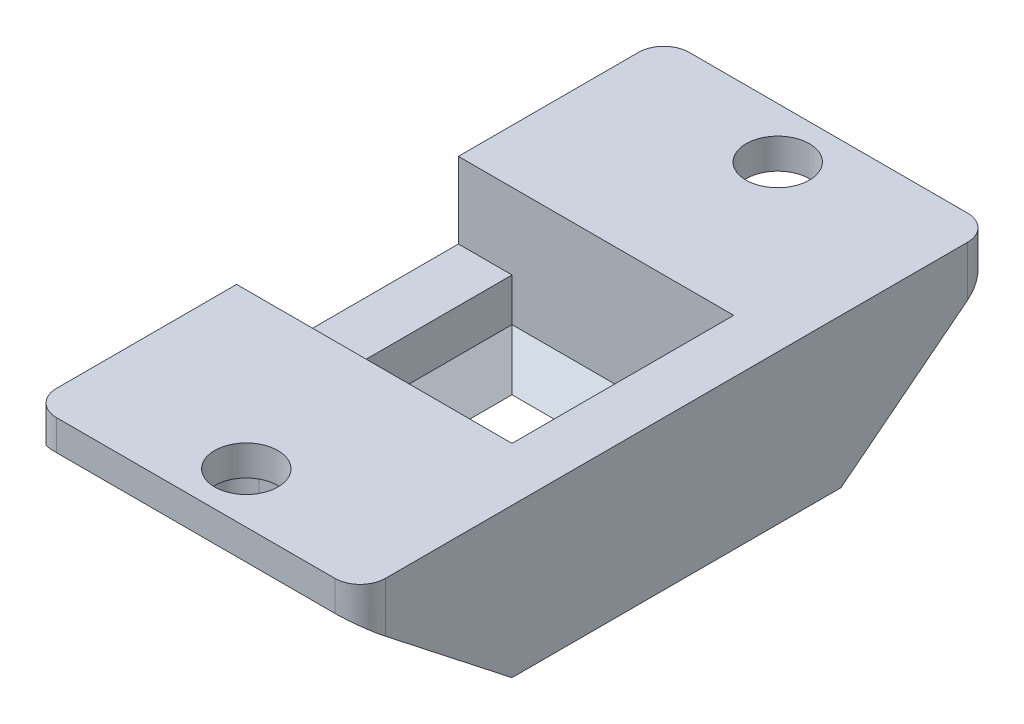
ISO-10303-21;
HEADER;
FILE_DESCRIPTION(('STEP AP214'),'2;1');
FILE_NAME('part.step','',(''),(''),'','','');
FILE_SCHEMA(('AUTOMOTIVE_DESIGN { 1 0 10303 214 1 1 1 1 }'));
ENDSEC;
DATA;
#1=APPLICATION_CONTEXT('core data for automotive mechanical design processes');
#2=APPLICATION_PROTOCOL_DEFINITION('international standard','automotive_design',2000,#1);
#3=PRODUCT_CONTEXT('',#1,'mechanical');
#4=PRODUCT('Part','Part','',(#3));
#5=PRODUCT_RELATED_PRODUCT_CATEGORY('part','',(#4));
#6=PRODUCT_DEFINITION_FORMATION('','',#4);
#7=PRODUCT_DEFINITION_CONTEXT('part definition',#1,'design');
#8=PRODUCT_DEFINITION('design','',#6,#7);
#9=PRODUCT_DEFINITION_SHAPE('','',#8);
#10=(LENGTH_UNIT() NAMED_UNIT(*) SI_UNIT(.MILLI.,.METRE.));
#11=(NAMED_UNIT(*) PLANE_ANGLE_UNIT() SI_UNIT($,.RADIAN.));
#12=(NAMED_UNIT(*) SI_UNIT($,.STERADIAN.) SOLID_ANGLE_UNIT());
#13=UNCERTAINTY_MEASURE_WITH_UNIT(LENGTH_MEASURE(1.E-05),#10,'distance_accuracy_value','');
#14=(GEOMETRIC_REPRESENTATION_CONTEXT(3) GLOBAL_UNCERTAINTY_ASSIGNED_CONTEXT((#13)) GLOBAL_UNIT_ASSIGNED_CONTEXT((#10,
#11,#12)) REPRESENTATION_CONTEXT('',''));
#15=CARTESIAN_POINT('',(0.,0.,0.));
#16=DIRECTION('',(0.,0.,1.));
#17=DIRECTION('',(1.,0.,0.));
#18=AXIS2_PLACEMENT_3D('',#15,#16,#17);
#19=CARTESIAN_POINT('',(-6.5,28.9847763108502,6.5));
#20=DIRECTION('',(0.,0.,1.));
#21=DIRECTION('',(1.,0.,0.));
#22=AXIS2_PLACEMENT_3D('',#19,#20,#21);
#23=PLANE('',#22);
#24=DIRECTION('',(1.,0.,0.));
#25=VECTOR('',#24,1.);
#26=CARTESIAN_POINT('',(-6.5,4.7,6.5));
#27=LINE('',#26,#25);
#28=CARTESIAN_POINT('',(-3.5,4.7,6.5));
#29=VERTEX_POINT('',#28);
#30=CARTESIAN_POINT('',(3.5,4.7,6.5));
#31=VERTEX_POINT('',#30);
#32=EDGE_CURVE('E389',#29,#31,#27,.T.);
#33=ORIENTED_EDGE('',*,*,#32,.F.);
#34=DIRECTION('',(0.,-1.,0.));
#35=VECTOR('',#34,1.);
#36=CARTESIAN_POINT('',(-3.5,28.9847763108502,6.5));
#37=LINE('',#36,#35);
#38=CARTESIAN_POINT('',(-3.5,0.,6.5));
#39=VERTEX_POINT('',#38);
#40=EDGE_CURVE('E312',#29,#39,#37,.T.);
#41=ORIENTED_EDGE('',*,*,#40,.T.);
#42=DIRECTION('',(-1.,0.,0.));
#43=VECTOR('',#42,1.);
#44=CARTESIAN_POINT('',(-6.5,0.,6.5));
#45=LINE('',#44,#43);
#46=CARTESIAN_POINT('',(3.5,0.,6.5));
#47=VERTEX_POINT('',#46);
#48=EDGE_CURVE('E425',#47,#39,#45,.T.);
#49=ORIENTED_EDGE('',*,*,#48,.F.);
#50=DIRECTION('',(0.,-1.,0.));
#51=VECTOR('',#50,1.);
#52=CARTESIAN_POINT('',(3.5,28.9847763108502,6.5));
#53=LINE('',#52,#51);
#54=EDGE_CURVE('E310',#47,#31,#53,.F.);
#55=ORIENTED_EDGE('',*,*,#54,.T.);
#56=EDGE_LOOP('',(#33,#41,#49,#55));
#57=FACE_BOUND('',#56,.T.);
#58=ADVANCED_FACE('F35',(#57),#23,.T.);
#59=CARTESIAN_POINT('',(0.,4.7,0.));
#60=DIRECTION('',(0.,-1.,0.));
#61=DIRECTION('',(0.,0.,1.));
#62=AXIS2_PLACEMENT_3D('',#59,#60,#61);
#63=PLANE('',#62);
#64=CARTESIAN_POINT('',(0.,4.7,10.5));
#65=DIRECTION('',(0.,-1.,0.));
#66=DIRECTION('',(0.,0.,-1.));
#67=AXIS2_PLACEMENT_3D('',#64,#65,#66);
#68=CIRCLE('',#67,1.25);
#69=CARTESIAN_POINT('',(0.,4.7,9.25));
#70=VERTEX_POINT('',#69);
#71=EDGE_CURVE('E406',#70,#70,#68,.T.);
#72=ORIENTED_EDGE('',*,*,#71,.F.);
#73=EDGE_LOOP('',(#72));
#74=FACE_BOUND('',#73,.T.);
#75=DIRECTION('',(0.,0.,-1.));
#76=VECTOR('',#75,1.);
#77=CARTESIAN_POINT('',(-4.5,4.7,12.5));
#78=LINE('',#77,#76);
#79=CARTESIAN_POINT('',(-4.5,4.7,12.5));
#80=VERTEX_POINT('',#79);
#81=CARTESIAN_POINT('',(-4.5,4.7,7.5));
#82=VERTEX_POINT('',#81);
#83=EDGE_CURVE('E381',#80,#82,#78,.T.);
#84=ORIENTED_EDGE('',*,*,#83,.T.);
#85=CARTESIAN_POINT('',(-3.5,4.7,7.5));
#86=DIRECTION('',(0.,-1.,0.));
#87=DIRECTION('',(0.,0.,-1.));
#88=AXIS2_PLACEMENT_3D('',#85,#86,#87);
#89=CIRCLE('',#88,1.);
#90=EDGE_CURVE('E319',#82,#29,#89,.T.);
#91=ORIENTED_EDGE('',*,*,#90,.T.);
#92=ORIENTED_EDGE('',*,*,#32,.T.);
#93=CARTESIAN_POINT('',(3.5,4.7,7.5));
#94=DIRECTION('',(0.,-1.,0.));
#95=DIRECTION('',(0.,0.,-1.));
#96=AXIS2_PLACEMENT_3D('',#93,#94,#95);
#97=CIRCLE('',#96,1.);
#98=CARTESIAN_POINT('',(4.5,4.7,7.5));
#99=VERTEX_POINT('',#98);
#100=EDGE_CURVE('E317',#31,#99,#97,.T.);
#101=ORIENTED_EDGE('',*,*,#100,.T.);
#102=DIRECTION('',(0.,0.,-1.));
#103=VECTOR('',#102,1.);
#104=CARTESIAN_POINT('',(4.5,4.7,12.5));
#105=LINE('',#104,#103);
#106=CARTESIAN_POINT('',(4.5,4.7,12.5));
#107=VERTEX_POINT('',#106);
#108=EDGE_CURVE('E596',#107,#99,#105,.T.);
#109=ORIENTED_EDGE('',*,*,#108,.F.);
#110=DIRECTION('',(-1.,0.,0.));
#111=VECTOR('',#110,1.);
#112=CARTESIAN_POINT('',(-6.5,4.7,12.5));
#113=LINE('',#112,#111);
#114=EDGE_CURVE('E399',#107,#80,#113,.T.);
#115=ORIENTED_EDGE('',*,*,#114,.T.);
#116=EDGE_LOOP('',(#84,#91,#92,#101,#109,#115));
#117=FACE_BOUND('',#116,.T.);
#118=ADVANCED_FACE('F388',(#74,#117),#63,.T.);
#119=CARTESIAN_POINT('',(-6.5,28.9847763108502,-6.5));
#120=DIRECTION('',(0.,0.,-1.));
#121=DIRECTION('',(-1.,0.,0.));
#122=AXIS2_PLACEMENT_3D('',#119,#120,#121);
#123=PLANE('',#122);
#124=DIRECTION('',(1.,0.,0.));
#125=VECTOR('',#124,1.);
#126=CARTESIAN_POINT('',(-6.5,0.,-6.5));
#127=LINE('',#126,#125);
#128=CARTESIAN_POINT('',(-3.5,0.,-6.5));
#129=VERTEX_POINT('',#128);
#130=CARTESIAN_POINT('',(3.5,0.,-6.5));
#131=VERTEX_POINT('',#130);
#132=EDGE_CURVE('E420',#129,#131,#127,.T.);
#133=ORIENTED_EDGE('',*,*,#132,.F.);
#134=DIRECTION('',(0.,1.,0.));
#135=VECTOR('',#134,1.);
#136=CARTESIAN_POINT('',(-3.5,4.7,-6.5));
#137=LINE('',#136,#135);
#138=CARTESIAN_POINT('',(-3.5,4.7,-6.5));
#139=VERTEX_POINT('',#138);
#140=EDGE_CURVE('E298',#129,#139,#137,.T.);
#141=ORIENTED_EDGE('',*,*,#140,.T.);
#142=DIRECTION('',(1.,0.,0.));
#143=VECTOR('',#142,1.);
#144=CARTESIAN_POINT('',(-6.5,4.7,-6.5));
#145=LINE('',#144,#143);
#146=CARTESIAN_POINT('',(3.5,4.7,-6.5));
#147=VERTEX_POINT('',#146);
#148=EDGE_CURVE('E410',#139,#147,#145,.T.);
#149=ORIENTED_EDGE('',*,*,#148,.T.);
#150=DIRECTION('',(0.,1.,0.));
#151=VECTOR('',#150,1.);
#152=CARTESIAN_POINT('',(3.5,0.,-6.5));
#153=LINE('',#152,#151);
#154=EDGE_CURVE('E283',#147,#131,#153,.F.);
#155=ORIENTED_EDGE('',*,*,#154,.T.);
#156=EDGE_LOOP('',(#133,#141,#149,#155));
#157=FACE_BOUND('',#156,.T.);
#158=ADVANCED_FACE('F497',(#157),#123,.T.);
#159=CARTESIAN_POINT('',(0.,0.,0.));
#160=DIRECTION('',(0.,1.,0.));
#161=DIRECTION('',(0.,0.,1.));
#162=AXIS2_PLACEMENT_3D('',#159,#160,#161);
#163=PLANE('',#162);
#164=DIRECTION('',(0.,0.,1.));
#165=VECTOR('',#164,1.);
#166=CARTESIAN_POINT('',(3.18150000000002,0.,2.8815));
#167=LINE('',#166,#165);
#168=CARTESIAN_POINT('',(3.18150000000002,0.,3.18150000000002));
#169=VERTEX_POINT('',#168);
#170=CARTESIAN_POINT('',(3.18150000000002,0.,-3.18150000000002));
#171=VERTEX_POINT('',#170);
#172=EDGE_CURVE('E278',#169,#171,#167,.F.);
#173=ORIENTED_EDGE('',*,*,#172,.T.);
#174=DIRECTION('',(1.,0.,0.));
#175=VECTOR('',#174,1.);
#176=CARTESIAN_POINT('',(-2.8815,0.,-3.18150000000002));
#177=LINE('',#176,#175);
#178=CARTESIAN_POINT('',(-3.18150000000002,0.,-3.18150000000002));
#179=VERTEX_POINT('',#178);
#180=EDGE_CURVE('E280',#171,#179,#177,.F.);
#181=ORIENTED_EDGE('',*,*,#180,.T.);
#182=DIRECTION('',(0.,0.,-1.));
#183=VECTOR('',#182,1.);
#184=CARTESIAN_POINT('',(-3.18150000000002,0.,2.8815));
#185=LINE('',#184,#183);
#186=CARTESIAN_POINT('',(-3.18150000000002,0.,3.18150000000002));
#187=VERTEX_POINT('',#186);
#188=EDGE_CURVE('E274',#179,#187,#185,.F.);
#189=ORIENTED_EDGE('',*,*,#188,.T.);
#190=DIRECTION('',(-1.,0.,0.));
#191=VECTOR('',#190,1.);
#192=CARTESIAN_POINT('',(-2.8815,0.,3.18150000000002));
#193=LINE('',#192,#191);
#194=EDGE_CURVE('E276',#187,#169,#193,.F.);
#195=ORIENTED_EDGE('',*,*,#194,.T.);
#196=EDGE_LOOP('',(#173,#181,#189,#195));
#197=FACE_BOUND('',#196,.T.);
#198=DIRECTION('',(0.,0.,1.));
#199=VECTOR('',#198,1.);
#200=CARTESIAN_POINT('',(6.5,0.,6.5));
#201=LINE('',#200,#199);
#202=CARTESIAN_POINT('',(6.5,0.,-6.5));
#203=VERTEX_POINT('',#202);
#204=CARTESIAN_POINT('',(6.5,0.,6.5));
#205=VERTEX_POINT('',#204);
#206=EDGE_CURVE('E264',#203,#205,#201,.T.);
#207=ORIENTED_EDGE('',*,*,#206,.T.);
#208=EDGE_CURVE('E58',#205,#47,#45,.T.);
#209=ORIENTED_EDGE('',*,*,#208,.T.);
#210=ORIENTED_EDGE('',*,*,#48,.T.);
#211=DIRECTION('',(-1.,0.,0.));
#212=VECTOR('',#211,1.);
#213=CARTESIAN_POINT('',(-4.5,0.,6.5));
#214=LINE('',#213,#212);
#215=CARTESIAN_POINT('',(-6.5,0.,6.5));
#216=VERTEX_POINT('',#215);
#217=EDGE_CURVE('E373',#39,#216,#214,.T.);
#218=ORIENTED_EDGE('',*,*,#217,.T.);
#219=DIRECTION('',(0.,0.,-1.));
#220=VECTOR('',#219,1.);
#221=CARTESIAN_POINT('',(-6.5,0.,6.5));
#222=LINE('',#221,#220);
#223=CARTESIAN_POINT('',(-6.5,0.,-6.5));
#224=VERTEX_POINT('',#223);
#225=EDGE_CURVE('E421',#216,#224,#222,.T.);
#226=ORIENTED_EDGE('',*,*,#225,.T.);
#227=EDGE_CURVE('E417',#224,#129,#127,.T.);
#228=ORIENTED_EDGE('',*,*,#227,.T.);
#229=ORIENTED_EDGE('',*,*,#132,.T.);
#230=DIRECTION('',(1.,0.,0.));
#231=VECTOR('',#230,1.);
#232=CARTESIAN_POINT('',(4.5,0.,-6.5));
#233=LINE('',#232,#231);
#234=EDGE_CURVE('E593',#131,#203,#233,.T.);
#235=ORIENTED_EDGE('',*,*,#234,.T.);
#236=EDGE_LOOP('',(#207,#209,#210,#218,#226,#228,#229,#235));
#237=FACE_BOUND('',#236,.T.);
#238=ADVANCED_FACE('F507',(#197,#237),#163,.F.);
#239=CARTESIAN_POINT('',(6.5,28.9847763108502,6.5));
#240=DIRECTION('',(1.,0.,0.));
#241=DIRECTION('',(0.,0.,-1.));
#242=AXIS2_PLACEMENT_3D('',#239,#240,#241);
#243=PLANE('',#242);
#244=DIRECTION('',(0.,0.,1.));
#245=VECTOR('',#244,1.);
#246=CARTESIAN_POINT('',(6.5,5.9,6.5));
#247=LINE('',#246,#245);
#248=CARTESIAN_POINT('',(6.5,5.9,-11.5));
#249=VERTEX_POINT('',#248);
#250=CARTESIAN_POINT('',(6.5,5.9,11.5));
#251=VERTEX_POINT('',#250);
#252=EDGE_CURVE('E295',#249,#251,#247,.T.);
#253=ORIENTED_EDGE('',*,*,#252,.T.);
#254=DIRECTION('',(0.,1.,0.));
#255=VECTOR('',#254,1.);
#256=CARTESIAN_POINT('',(6.5,4.7,11.5));
#257=LINE('',#256,#255);
#258=CARTESIAN_POINT('',(6.5,3.91666666666667,11.5));
#259=VERTEX_POINT('',#258);
#260=EDGE_CURVE('E348',#251,#259,#257,.F.);
#261=ORIENTED_EDGE('',*,*,#260,.T.);
#262=DIRECTION('',(0.,0.616661975264374,0.787228053528989));
#263=VECTOR('',#262,1.);
#264=CARTESIAN_POINT('',(6.5,4.7,12.5));
#265=LINE('',#264,#263);
#266=EDGE_CURVE('E595',#205,#259,#265,.T.);
#267=ORIENTED_EDGE('',*,*,#266,.F.);
#268=ORIENTED_EDGE('',*,*,#206,.F.);
#269=DIRECTION('',(0.,-0.616661975264374,0.787228053528989));
#270=VECTOR('',#269,1.);
#271=CARTESIAN_POINT('',(6.5,0.,-6.5));
#272=LINE('',#271,#270);
#273=CARTESIAN_POINT('',(6.5,3.91666666666667,-11.5));
#274=VERTEX_POINT('',#273);
#275=EDGE_CURVE('E242',#274,#203,#272,.T.);
#276=ORIENTED_EDGE('',*,*,#275,.F.);
#277=DIRECTION('',(0.,1.,0.));
#278=VECTOR('',#277,1.);
#279=CARTESIAN_POINT('',(6.5,28.9847763108502,-11.5));
#280=LINE('',#279,#278);
#281=EDGE_CURVE('E345',#274,#249,#280,.T.);
#282=ORIENTED_EDGE('',*,*,#281,.T.);
#283=EDGE_LOOP('',(#253,#261,#267,#268,#276,#282));
#284=FACE_BOUND('',#283,.T.);
#285=ADVANCED_FACE('F504',(#284),#243,.T.);
#286=CARTESIAN_POINT('',(-6.5,28.9847763108502,6.5));
#287=DIRECTION('',(-1.,0.,0.));
#288=DIRECTION('',(0.,0.,1.));
#289=AXIS2_PLACEMENT_3D('',#286,#287,#288);
#290=PLANE('',#289);
#291=DIRECTION('',(0.,-1.,0.));
#292=VECTOR('',#291,1.);
#293=CARTESIAN_POINT('',(-6.5,2.9,-4.3815));
#294=LINE('',#293,#292);
#295=CARTESIAN_POINT('',(-6.5,5.9,-4.3815));
#296=VERTEX_POINT('',#295);
#297=CARTESIAN_POINT('',(-6.5,2.9,-4.3815));
#298=VERTEX_POINT('',#297);
#299=EDGE_CURVE('E230',#296,#298,#294,.T.);
#300=ORIENTED_EDGE('',*,*,#299,.F.);
#301=DIRECTION('',(0.,0.,-1.));
#302=VECTOR('',#301,1.);
#303=CARTESIAN_POINT('',(-6.5,5.9,6.5));
#304=LINE('',#303,#302);
#305=CARTESIAN_POINT('',(-6.5,5.9,-11.5));
#306=VERTEX_POINT('',#305);
#307=EDGE_CURVE('E254',#296,#306,#304,.T.);
#308=ORIENTED_EDGE('',*,*,#307,.T.);
#309=DIRECTION('',(0.,1.,0.));
#310=VECTOR('',#309,1.);
#311=CARTESIAN_POINT('',(-6.5,28.9847763108502,-11.5));
#312=LINE('',#311,#310);
#313=CARTESIAN_POINT('',(-6.5,3.91666666666667,-11.5));
#314=VERTEX_POINT('',#313);
#315=EDGE_CURVE('E324',#306,#314,#312,.F.);
#316=ORIENTED_EDGE('',*,*,#315,.T.);
#317=DIRECTION('',(0.,-0.616661975264374,0.787228053528989));
#318=VECTOR('',#317,1.);
#319=CARTESIAN_POINT('',(-6.5,0.,-6.5));
#320=LINE('',#319,#318);
#321=EDGE_CURVE('E454',#314,#224,#320,.T.);
#322=ORIENTED_EDGE('',*,*,#321,.T.);
#323=ORIENTED_EDGE('',*,*,#225,.F.);
#324=DIRECTION('',(0.,0.616661975264374,0.787228053528989));
#325=VECTOR('',#324,1.);
#326=CARTESIAN_POINT('',(-6.5,4.7,12.5));
#327=LINE('',#326,#325);
#328=CARTESIAN_POINT('',(-6.5,3.91666666666667,11.5));
#329=VERTEX_POINT('',#328);
#330=EDGE_CURVE('E459',#216,#329,#327,.T.);
#331=ORIENTED_EDGE('',*,*,#330,.T.);
#332=DIRECTION('',(0.,1.,0.));
#333=VECTOR('',#332,1.);
#334=CARTESIAN_POINT('',(-6.5,5.9,11.5));
#335=LINE('',#334,#333);
#336=CARTESIAN_POINT('',(-6.5,5.9,11.5));
#337=VERTEX_POINT('',#336);
#338=EDGE_CURVE('E326',#329,#337,#335,.T.);
#339=ORIENTED_EDGE('',*,*,#338,.T.);
#340=CARTESIAN_POINT('',(-6.5,5.9,4.3815));
#341=VERTEX_POINT('',#340);
#342=EDGE_CURVE('E249',#337,#341,#304,.T.);
#343=ORIENTED_EDGE('',*,*,#342,.T.);
#344=DIRECTION('',(0.,1.,0.));
#345=VECTOR('',#344,1.);
#346=CARTESIAN_POINT('',(-6.5,2.9,4.3815));
#347=LINE('',#346,#345);
#348=CARTESIAN_POINT('',(-6.5,2.9,4.3815));
#349=VERTEX_POINT('',#348);
#350=EDGE_CURVE('E235',#349,#341,#347,.T.);
#351=ORIENTED_EDGE('',*,*,#350,.F.);
#352=DIRECTION('',(0.,0.,1.));
#353=VECTOR('',#352,1.);
#354=CARTESIAN_POINT('',(-6.5,2.9,4.3815));
#355=LINE('',#354,#353);
#356=EDGE_CURVE('E912',#298,#349,#355,.T.);
#357=ORIENTED_EDGE('',*,*,#356,.F.);
#358=EDGE_LOOP('',(#300,#308,#316,#322,#323,#331,#339,#343,#351,#357));
#359=FACE_BOUND('',#358,.T.);
#360=ADVANCED_FACE('F436',(#359),#290,.T.);
#361=CARTESIAN_POINT('',(-4.3815,28.9847763108502,-4.3815));
#362=DIRECTION('',(0.,0.,-1.));
#363=DIRECTION('',(-1.,0.,0.));
#364=AXIS2_PLACEMENT_3D('',#361,#362,#363);
#365=PLANE('',#364);
#366=DIRECTION('',(-1.,0.,0.));
#367=VECTOR('',#366,1.);
#368=CARTESIAN_POINT('',(-4.3815,1.2,-4.3815));
#369=LINE('',#368,#367);
#370=CARTESIAN_POINT('',(4.3815,1.2,-4.3815));
#371=VERTEX_POINT('',#370);
#372=CARTESIAN_POINT('',(-4.3815,1.2,-4.3815));
#373=VERTEX_POINT('',#372);
#374=EDGE_CURVE('E268',#371,#373,#369,.T.);
#375=ORIENTED_EDGE('',*,*,#374,.F.);
#376=DIRECTION('',(0.,-1.,0.));
#377=VECTOR('',#376,1.);
#378=CARTESIAN_POINT('',(4.3815,28.9847763108502,-4.3815));
#379=LINE('',#378,#377);
#380=CARTESIAN_POINT('',(4.3815,5.9,-4.3815));
#381=VERTEX_POINT('',#380);
#382=EDGE_CURVE('E261',#381,#371,#379,.T.);
#383=ORIENTED_EDGE('',*,*,#382,.F.);
#384=DIRECTION('',(1.,0.,0.));
#385=VECTOR('',#384,1.);
#386=CARTESIAN_POINT('',(-4.3815,5.9,-4.3815));
#387=LINE('',#386,#385);
#388=EDGE_CURVE('E419',#296,#381,#387,.T.);
#389=ORIENTED_EDGE('',*,*,#388,.F.);
#390=ORIENTED_EDGE('',*,*,#299,.T.);
#391=DIRECTION('',(-1.,0.,0.));
#392=VECTOR('',#391,1.);
#393=CARTESIAN_POINT('',(6.501,2.9,-4.3815));
#394=LINE('',#393,#392);
#395=CARTESIAN_POINT('',(-4.3815,2.9,-4.3815));
#396=VERTEX_POINT('',#395);
#397=EDGE_CURVE('E222',#396,#298,#394,.T.);
#398=ORIENTED_EDGE('',*,*,#397,.F.);
#399=DIRECTION('',(0.,-1.,0.));
#400=VECTOR('',#399,1.);
#401=CARTESIAN_POINT('',(-4.3815,28.9847763108502,-4.3815));
#402=LINE('',#401,#400);
#403=EDGE_CURVE('E227',#396,#373,#402,.T.);
#404=ORIENTED_EDGE('',*,*,#403,.T.);
#405=EDGE_LOOP('',(#375,#383,#389,#390,#398,#404));
#406=FACE_BOUND('',#405,.T.);
#407=ADVANCED_FACE('F225',(#406),#365,.F.);
#408=CARTESIAN_POINT('',(-4.3815,28.9847763108502,4.3815));
#409=DIRECTION('',(-1.,0.,0.));
#410=DIRECTION('',(0.,0.,1.));
#411=AXIS2_PLACEMENT_3D('',#408,#409,#410);
#412=PLANE('',#411);
#413=ORIENTED_EDGE('',*,*,#403,.F.);
#414=DIRECTION('',(0.,0.,-1.));
#415=VECTOR('',#414,1.);
#416=CARTESIAN_POINT('',(-4.3815,2.9,4.3815));
#417=LINE('',#416,#415);
#418=CARTESIAN_POINT('',(-4.3815,2.9,4.3815));
#419=VERTEX_POINT('',#418);
#420=EDGE_CURVE('E238',#419,#396,#417,.T.);
#421=ORIENTED_EDGE('',*,*,#420,.F.);
#422=DIRECTION('',(0.,-1.,0.));
#423=VECTOR('',#422,1.);
#424=CARTESIAN_POINT('',(-4.3815,28.9847763108502,4.3815));
#425=LINE('',#424,#423);
#426=CARTESIAN_POINT('',(-4.3815,1.2,4.3815));
#427=VERTEX_POINT('',#426);
#428=EDGE_CURVE('E248',#419,#427,#425,.T.);
#429=ORIENTED_EDGE('',*,*,#428,.T.);
#430=DIRECTION('',(0.,0.,1.));
#431=VECTOR('',#430,1.);
#432=CARTESIAN_POINT('',(-4.3815,1.2,-4.3815));
#433=LINE('',#432,#431);
#434=EDGE_CURVE('E246',#373,#427,#433,.T.);
#435=ORIENTED_EDGE('',*,*,#434,.F.);
#436=EDGE_LOOP('',(#413,#421,#429,#435));
#437=FACE_BOUND('',#436,.T.);
#438=ADVANCED_FACE('F244',(#437),#412,.F.);
#439=CARTESIAN_POINT('',(4.3815,28.9847763108502,4.3815));
#440=DIRECTION('',(0.,0.,1.));
#441=DIRECTION('',(1.,0.,0.));
#442=AXIS2_PLACEMENT_3D('',#439,#440,#441);
#443=PLANE('',#442);
#444=DIRECTION('',(1.,0.,0.));
#445=VECTOR('',#444,1.);
#446=CARTESIAN_POINT('',(-4.3815,1.2,4.3815));
#447=LINE('',#446,#445);
#448=CARTESIAN_POINT('',(4.3815,1.2,4.3815));
#449=VERTEX_POINT('',#448);
#450=EDGE_CURVE('E271',#427,#449,#447,.T.);
#451=ORIENTED_EDGE('',*,*,#450,.F.);
#452=ORIENTED_EDGE('',*,*,#428,.F.);
#453=DIRECTION('',(-1.,0.,0.));
#454=VECTOR('',#453,1.);
#455=CARTESIAN_POINT('',(6.501,2.9,4.3815));
#456=LINE('',#455,#454);
#457=EDGE_CURVE('E234',#419,#349,#456,.T.);
#458=ORIENTED_EDGE('',*,*,#457,.T.);
#459=ORIENTED_EDGE('',*,*,#350,.T.);
#460=DIRECTION('',(-1.,0.,0.));
#461=VECTOR('',#460,1.);
#462=CARTESIAN_POINT('',(4.3815,5.9,4.3815));
#463=LINE('',#462,#461);
#464=CARTESIAN_POINT('',(4.3815,5.9,4.3815));
#465=VERTEX_POINT('',#464);
#466=EDGE_CURVE('E50',#465,#341,#463,.T.);
#467=ORIENTED_EDGE('',*,*,#466,.F.);
#468=DIRECTION('',(0.,-1.,0.));
#469=VECTOR('',#468,1.);
#470=CARTESIAN_POINT('',(4.3815,28.9847763108502,4.3815));
#471=LINE('',#470,#469);
#472=EDGE_CURVE('E251',#465,#449,#471,.T.);
#473=ORIENTED_EDGE('',*,*,#472,.T.);
#474=EDGE_LOOP('',(#451,#452,#458,#459,#467,#473));
#475=FACE_BOUND('',#474,.T.);
#476=ADVANCED_FACE('F514',(#475),#443,.F.);
#477=CARTESIAN_POINT('',(4.3815,28.9847763108502,-4.3815));
#478=DIRECTION('',(1.,0.,0.));
#479=DIRECTION('',(0.,0.,-1.));
#480=AXIS2_PLACEMENT_3D('',#477,#478,#479);
#481=PLANE('',#480);
#482=DIRECTION('',(0.,0.,-1.));
#483=VECTOR('',#482,1.);
#484=CARTESIAN_POINT('',(4.3815,1.2,-4.3815));
#485=LINE('',#484,#483);
#486=EDGE_CURVE('E265',#449,#371,#485,.T.);
#487=ORIENTED_EDGE('',*,*,#486,.F.);
#488=ORIENTED_EDGE('',*,*,#472,.F.);
#489=DIRECTION('',(0.,0.,1.));
#490=VECTOR('',#489,1.);
#491=CARTESIAN_POINT('',(4.3815,5.9,-4.3815));
#492=LINE('',#491,#490);
#493=EDGE_CURVE('E257',#381,#465,#492,.T.);
#494=ORIENTED_EDGE('',*,*,#493,.F.);
#495=ORIENTED_EDGE('',*,*,#382,.T.);
#496=EDGE_LOOP('',(#487,#488,#494,#495));
#497=FACE_BOUND('',#496,.T.);
#498=ADVANCED_FACE('F511',(#497),#481,.F.);
#499=CARTESIAN_POINT('',(0.,5.9,0.));
#500=DIRECTION('',(0.,1.,0.));
#501=DIRECTION('',(0.,0.,1.));
#502=AXIS2_PLACEMENT_3D('',#499,#500,#501);
#503=PLANE('',#502);
#504=ORIENTED_EDGE('',*,*,#307,.F.);
#505=ORIENTED_EDGE('',*,*,#388,.T.);
#506=ORIENTED_EDGE('',*,*,#493,.T.);
#507=ORIENTED_EDGE('',*,*,#466,.T.);
#508=ORIENTED_EDGE('',*,*,#342,.F.);
#509=CARTESIAN_POINT('',(-5.5,5.9,11.5));
#510=DIRECTION('',(0.,1.,0.));
#511=DIRECTION('',(0.,0.,1.));
#512=AXIS2_PLACEMENT_3D('',#509,#510,#511);
#513=CIRCLE('',#512,1.);
#514=CARTESIAN_POINT('',(-5.5,5.9,12.5));
#515=VERTEX_POINT('',#514);
#516=EDGE_CURVE('E336',#337,#515,#513,.T.);
#517=ORIENTED_EDGE('',*,*,#516,.T.);
#518=DIRECTION('',(-1.,0.,0.));
#519=VECTOR('',#518,1.);
#520=CARTESIAN_POINT('',(-6.5,5.9,12.5));
#521=LINE('',#520,#519);
#522=CARTESIAN_POINT('',(5.49999999999999,5.9,12.5));
#523=VERTEX_POINT('',#522);
#524=EDGE_CURVE('E403',#523,#515,#521,.T.);
#525=ORIENTED_EDGE('',*,*,#524,.F.);
#526=CARTESIAN_POINT('',(5.5,5.9,11.5));
#527=DIRECTION('',(0.,1.,0.));
#528=DIRECTION('',(0.,0.,1.));
#529=AXIS2_PLACEMENT_3D('',#526,#527,#528);
#530=CIRCLE('',#529,1.);
#531=EDGE_CURVE('E334',#523,#251,#530,.T.);
#532=ORIENTED_EDGE('',*,*,#531,.T.);
#533=ORIENTED_EDGE('',*,*,#252,.F.);
#534=CARTESIAN_POINT('',(5.5,5.9,-11.5));
#535=DIRECTION('',(0.,1.,0.));
#536=DIRECTION('',(0.,0.,1.));
#537=AXIS2_PLACEMENT_3D('',#534,#535,#536);
#538=CIRCLE('',#537,1.);
#539=CARTESIAN_POINT('',(5.5,5.9,-12.5));
#540=VERTEX_POINT('',#539);
#541=EDGE_CURVE('E329',#249,#540,#538,.T.);
#542=ORIENTED_EDGE('',*,*,#541,.T.);
#543=DIRECTION('',(-1.,0.,0.));
#544=VECTOR('',#543,1.);
#545=CARTESIAN_POINT('',(-6.5,5.9,-12.5));
#546=LINE('',#545,#544);
#547=CARTESIAN_POINT('',(-5.5,5.9,-12.5));
#548=VERTEX_POINT('',#547);
#549=EDGE_CURVE('E408',#540,#548,#546,.T.);
#550=ORIENTED_EDGE('',*,*,#549,.T.);
#551=CARTESIAN_POINT('',(-5.5,5.9,-11.5));
#552=DIRECTION('',(0.,1.,0.));
#553=DIRECTION('',(0.,0.,1.));
#554=AXIS2_PLACEMENT_3D('',#551,#552,#553);
#555=CIRCLE('',#554,1.);
#556=EDGE_CURVE('E331',#548,#306,#555,.T.);
#557=ORIENTED_EDGE('',*,*,#556,.T.);
#558=EDGE_LOOP('',(#504,#505,#506,#507,#508,#517,#525,#532,#533,#542,#550,#557));
#559=FACE_BOUND('',#558,.T.);
#560=CARTESIAN_POINT('',(0.,5.9,-10.5));
#561=DIRECTION('',(0.,1.,0.));
#562=DIRECTION('',(0.,0.,1.));
#563=AXIS2_PLACEMENT_3D('',#560,#561,#562);
#564=CIRCLE('',#563,1.25);
#565=CARTESIAN_POINT('',(0.,5.9,-9.25));
#566=VERTEX_POINT('',#565);
#567=EDGE_CURVE('E393',#566,#566,#564,.T.);
#568=ORIENTED_EDGE('',*,*,#567,.F.);
#569=EDGE_LOOP('',(#568));
#570=FACE_BOUND('',#569,.T.);
#571=CARTESIAN_POINT('',(0.,5.9,10.5));
#572=DIRECTION('',(0.,-1.,0.));
#573=DIRECTION('',(0.,0.,-1.));
#574=AXIS2_PLACEMENT_3D('',#571,#572,#573);
#575=CIRCLE('',#574,1.25);
#576=CARTESIAN_POINT('',(0.,5.9,9.25));
#577=VERTEX_POINT('',#576);
#578=EDGE_CURVE('E471',#577,#577,#575,.T.);
#579=ORIENTED_EDGE('',*,*,#578,.T.);
#580=EDGE_LOOP('',(#579));
#581=FACE_BOUND('',#580,.T.);
#582=ADVANCED_FACE('F439',(#559,#570,#581),#503,.T.);
#583=CARTESIAN_POINT('',(-2.8815,-0.300000000000026,2.8815));
#584=DIRECTION('',(0.,-0.707106781186544,0.707106781186551));
#585=DIRECTION('',(1.,0.,0.));
#586=AXIS2_PLACEMENT_3D('',#583,#584,#585);
#587=PLANE('',#586);
#588=DIRECTION('',(-0.577350269189624,0.57735026918963,0.577350269189624));
#589=VECTOR('',#588,1.);
#590=CARTESIAN_POINT('',(-2.8815,-0.300000000000026,2.8815));
#591=LINE('',#590,#589);
#592=EDGE_CURVE('E289',#427,#187,#591,.F.);
#593=ORIENTED_EDGE('',*,*,#592,.F.);
#594=ORIENTED_EDGE('',*,*,#450,.T.);
#595=DIRECTION('',(0.577350269189624,0.57735026918963,0.577350269189624));
#596=VECTOR('',#595,1.);
#597=CARTESIAN_POINT('',(0.960500000000014,-2.22100000000003,0.960500000000013));
#598=LINE('',#597,#596);
#599=EDGE_CURVE('E292',#169,#449,#598,.T.);
#600=ORIENTED_EDGE('',*,*,#599,.F.);
#601=ORIENTED_EDGE('',*,*,#194,.F.);
#602=EDGE_LOOP('',(#593,#594,#600,#601));
#603=FACE_BOUND('',#602,.T.);
#604=ADVANCED_FACE('F525',(#603),#587,.F.);
#605=CARTESIAN_POINT('',(2.8815,-0.300000000000026,2.8815));
#606=DIRECTION('',(0.707106781186551,-0.707106781186544,0.));
#607=DIRECTION('',(0.,0.,-1.));
#608=AXIS2_PLACEMENT_3D('',#605,#606,#607);
#609=PLANE('',#608);
#610=ORIENTED_EDGE('',*,*,#599,.T.);
#611=ORIENTED_EDGE('',*,*,#486,.T.);
#612=DIRECTION('',(0.577350269189624,0.57735026918963,-0.577350269189624));
#613=VECTOR('',#612,1.);
#614=CARTESIAN_POINT('',(0.960500000000013,-2.22100000000003,-0.960500000000012));
#615=LINE('',#614,#613);
#616=EDGE_CURVE('E286',#171,#371,#615,.T.);
#617=ORIENTED_EDGE('',*,*,#616,.F.);
#618=ORIENTED_EDGE('',*,*,#172,.F.);
#619=EDGE_LOOP('',(#610,#611,#617,#618));
#620=FACE_BOUND('',#619,.T.);
#621=ADVANCED_FACE('F536',(#620),#609,.F.);
#622=CARTESIAN_POINT('',(-2.8815,-0.300000000000026,2.8815));
#623=DIRECTION('',(-0.707106781186551,-0.707106781186544,0.));
#624=DIRECTION('',(0.,0.,1.));
#625=AXIS2_PLACEMENT_3D('',#622,#623,#624);
#626=PLANE('',#625);
#627=ORIENTED_EDGE('',*,*,#592,.T.);
#628=ORIENTED_EDGE('',*,*,#188,.F.);
#629=DIRECTION('',(0.577350269189624,-0.57735026918963,0.577350269189624));
#630=VECTOR('',#629,1.);
#631=CARTESIAN_POINT('',(-0.960500000000013,-2.22100000000003,-0.960500000000012));
#632=LINE('',#631,#630);
#633=EDGE_CURVE('E284',#373,#179,#632,.T.);
#634=ORIENTED_EDGE('',*,*,#633,.F.);
#635=ORIENTED_EDGE('',*,*,#434,.T.);
#636=EDGE_LOOP('',(#627,#628,#634,#635));
#637=FACE_BOUND('',#636,.T.);
#638=ADVANCED_FACE('F532',(#637),#626,.F.);
#639=CARTESIAN_POINT('',(-2.8815,-0.300000000000026,-2.8815));
#640=DIRECTION('',(0.,-0.707106781186544,-0.707106781186551));
#641=DIRECTION('',(-1.,0.,0.));
#642=AXIS2_PLACEMENT_3D('',#639,#640,#641);
#643=PLANE('',#642);
#644=ORIENTED_EDGE('',*,*,#616,.T.);
#645=ORIENTED_EDGE('',*,*,#374,.T.);
#646=ORIENTED_EDGE('',*,*,#633,.T.);
#647=ORIENTED_EDGE('',*,*,#180,.F.);
#648=EDGE_LOOP('',(#644,#645,#646,#647));
#649=FACE_BOUND('',#648,.T.);
#650=ADVANCED_FACE('F529',(#649),#643,.F.);
#651=CARTESIAN_POINT('',(-6.5,4.7,-12.5));
#652=DIRECTION('',(0.,0.,-1.));
#653=DIRECTION('',(-1.,0.,0.));
#654=AXIS2_PLACEMENT_3D('',#651,#652,#653);
#655=PLANE('',#654);
#656=DIRECTION('',(-1.,0.,0.));
#657=VECTOR('',#656,1.);
#658=CARTESIAN_POINT('',(-4.5,4.7,-12.5));
#659=LINE('',#658,#657);
#660=CARTESIAN_POINT('',(-4.5,4.7,-12.5));
#661=VERTEX_POINT('',#660);
#662=CARTESIAN_POINT('',(-5.5,4.7,-12.5));
#663=VERTEX_POINT('',#662);
#664=EDGE_CURVE('E451',#661,#663,#659,.T.);
#665=ORIENTED_EDGE('',*,*,#664,.T.);
#666=DIRECTION('',(0.,1.,0.));
#667=VECTOR('',#666,1.);
#668=CARTESIAN_POINT('',(-5.5,4.7,-12.5));
#669=LINE('',#668,#667);
#670=EDGE_CURVE('E354',#663,#548,#669,.T.);
#671=ORIENTED_EDGE('',*,*,#670,.T.);
#672=ORIENTED_EDGE('',*,*,#549,.F.);
#673=DIRECTION('',(0.,1.,0.));
#674=VECTOR('',#673,1.);
#675=CARTESIAN_POINT('',(5.5,4.7,-12.5));
#676=LINE('',#675,#674);
#677=CARTESIAN_POINT('',(5.5,4.7,-12.5));
#678=VERTEX_POINT('',#677);
#679=EDGE_CURVE('E352',#540,#678,#676,.F.);
#680=ORIENTED_EDGE('',*,*,#679,.T.);
#681=DIRECTION('',(-1.,0.,0.));
#682=VECTOR('',#681,1.);
#683=CARTESIAN_POINT('',(-6.5,4.7,-12.5));
#684=LINE('',#683,#682);
#685=CARTESIAN_POINT('',(4.5,4.7,-12.5));
#686=VERTEX_POINT('',#685);
#687=EDGE_CURVE('E287',#678,#686,#684,.T.);
#688=ORIENTED_EDGE('',*,*,#687,.T.);
#689=EDGE_CURVE('E413',#686,#661,#684,.T.);
#690=ORIENTED_EDGE('',*,*,#689,.T.);
#691=EDGE_LOOP('',(#665,#671,#672,#680,#688,#690));
#692=FACE_BOUND('',#691,.T.);
#693=ADVANCED_FACE('F457',(#692),#655,.T.);
#694=CARTESIAN_POINT('',(0.,4.7,0.));
#695=DIRECTION('',(0.,-1.,0.));
#696=DIRECTION('',(0.,0.,-1.));
#697=AXIS2_PLACEMENT_3D('',#694,#695,#696);
#698=PLANE('',#697);
#699=ORIENTED_EDGE('',*,*,#148,.F.);
#700=CARTESIAN_POINT('',(-3.5,4.7,-7.5));
#701=DIRECTION('',(0.,-1.,0.));
#702=DIRECTION('',(0.,0.,-1.));
#703=AXIS2_PLACEMENT_3D('',#700,#701,#702);
#704=CIRCLE('',#703,1.);
#705=CARTESIAN_POINT('',(-4.5,4.7,-7.5));
#706=VERTEX_POINT('',#705);
#707=EDGE_CURVE('E303',#139,#706,#704,.T.);
#708=ORIENTED_EDGE('',*,*,#707,.T.);
#709=DIRECTION('',(0.,0.,-1.));
#710=VECTOR('',#709,1.);
#711=CARTESIAN_POINT('',(-4.5,4.7,-12.5));
#712=LINE('',#711,#710);
#713=EDGE_CURVE('E464',#706,#661,#712,.T.);
#714=ORIENTED_EDGE('',*,*,#713,.T.);
#715=ORIENTED_EDGE('',*,*,#689,.F.);
#716=DIRECTION('',(0.,0.,-1.));
#717=VECTOR('',#716,1.);
#718=CARTESIAN_POINT('',(4.5,4.7,-12.5));
#719=LINE('',#718,#717);
#720=CARTESIAN_POINT('',(4.5,4.7,-7.5));
#721=VERTEX_POINT('',#720);
#722=EDGE_CURVE('E586',#721,#686,#719,.T.);
#723=ORIENTED_EDGE('',*,*,#722,.F.);
#724=CARTESIAN_POINT('',(3.5,4.7,-7.5));
#725=DIRECTION('',(0.,-1.,0.));
#726=DIRECTION('',(0.,0.,-1.));
#727=AXIS2_PLACEMENT_3D('',#724,#725,#726);
#728=CIRCLE('',#727,1.);
#729=EDGE_CURVE('E301',#721,#147,#728,.T.);
#730=ORIENTED_EDGE('',*,*,#729,.T.);
#731=EDGE_LOOP('',(#699,#708,#714,#715,#723,#730));
#732=FACE_BOUND('',#731,.T.);
#733=CARTESIAN_POINT('',(0.,4.7,-10.5));
#734=DIRECTION('',(0.,1.,0.));
#735=DIRECTION('',(0.,0.,1.));
#736=AXIS2_PLACEMENT_3D('',#733,#734,#735);
#737=CIRCLE('',#736,1.25);
#738=CARTESIAN_POINT('',(0.,4.7,-9.25));
#739=VERTEX_POINT('',#738);
#740=EDGE_CURVE('E397',#739,#739,#737,.T.);
#741=ORIENTED_EDGE('',*,*,#740,.T.);
#742=EDGE_LOOP('',(#741));
#743=FACE_BOUND('',#742,.T.);
#744=ADVANCED_FACE('F634',(#732,#743),#698,.T.);
#745=CARTESIAN_POINT('',(0.,4.7,-10.5));
#746=DIRECTION('',(0.,1.,0.));
#747=DIRECTION('',(0.,0.,1.));
#748=AXIS2_PLACEMENT_3D('',#745,#746,#747);
#749=CYLINDRICAL_SURFACE('',#748,1.25);
#750=ORIENTED_EDGE('',*,*,#740,.F.);
#751=EDGE_LOOP('',(#750));
#752=FACE_BOUND('',#751,.T.);
#753=ORIENTED_EDGE('',*,*,#567,.T.);
#754=EDGE_LOOP('',(#753));
#755=FACE_BOUND('',#754,.T.);
#756=ADVANCED_FACE('F488',(#752,#755),#749,.F.);
#757=CARTESIAN_POINT('',(-6.5,4.7,12.5));
#758=DIRECTION('',(0.,0.,-1.));
#759=DIRECTION('',(-1.,0.,0.));
#760=AXIS2_PLACEMENT_3D('',#757,#758,#759);
#761=PLANE('',#760);
#762=ORIENTED_EDGE('',*,*,#524,.T.);
#763=DIRECTION('',(0.,1.,0.));
#764=VECTOR('',#763,1.);
#765=CARTESIAN_POINT('',(-5.5,4.7,12.5));
#766=LINE('',#765,#764);
#767=CARTESIAN_POINT('',(-5.5,4.7,12.5));
#768=VERTEX_POINT('',#767);
#769=EDGE_CURVE('E341',#515,#768,#766,.F.);
#770=ORIENTED_EDGE('',*,*,#769,.T.);
#771=DIRECTION('',(-1.,0.,0.));
#772=VECTOR('',#771,1.);
#773=CARTESIAN_POINT('',(-4.5,4.7,12.5));
#774=LINE('',#773,#772);
#775=EDGE_CURVE('E469',#80,#768,#774,.T.);
#776=ORIENTED_EDGE('',*,*,#775,.F.);
#777=ORIENTED_EDGE('',*,*,#114,.F.);
#778=CARTESIAN_POINT('',(5.49999999999999,4.7,12.5));
#779=VERTEX_POINT('',#778);
#780=EDGE_CURVE('E394',#779,#107,#113,.T.);
#781=ORIENTED_EDGE('',*,*,#780,.F.);
#782=DIRECTION('',(0.,1.,0.));
#783=VECTOR('',#782,1.);
#784=CARTESIAN_POINT('',(5.5,5.9,12.5));
#785=LINE('',#784,#783);
#786=EDGE_CURVE('E338',#779,#523,#785,.T.);
#787=ORIENTED_EDGE('',*,*,#786,.T.);
#788=EDGE_LOOP('',(#762,#770,#776,#777,#781,#787));
#789=FACE_BOUND('',#788,.T.);
#790=ADVANCED_FACE('F480',(#789),#761,.F.);
#791=CARTESIAN_POINT('',(0.,4.7,10.5));
#792=DIRECTION('',(0.,1.,0.));
#793=DIRECTION('',(0.,0.,1.));
#794=AXIS2_PLACEMENT_3D('',#791,#792,#793);
#795=CYLINDRICAL_SURFACE('',#794,1.25);
#796=ORIENTED_EDGE('',*,*,#71,.T.);
#797=EDGE_LOOP('',(#796));
#798=FACE_BOUND('',#797,.T.);
#799=ORIENTED_EDGE('',*,*,#578,.F.);
#800=EDGE_LOOP('',(#799));
#801=FACE_BOUND('',#800,.T.);
#802=ADVANCED_FACE('F478',(#798,#801),#795,.F.);
#803=CARTESIAN_POINT('',(-4.5,4.7,12.5));
#804=DIRECTION('',(0.,-0.787228053528989,0.616661975264374));
#805=DIRECTION('',(0.,-0.616661975264374,-0.787228053528989));
#806=AXIS2_PLACEMENT_3D('',#803,#804,#805);
#807=PLANE('',#806);
#808=ORIENTED_EDGE('',*,*,#775,.T.);
#809=CARTESIAN_POINT('',(-5.5,3.91666666666667,11.5));
#810=DIRECTION('',(0.,-0.787228053528989,0.616661975264374));
#811=DIRECTION('',(0.,-0.616661975264374,-0.787228053528989));
#812=AXIS2_PLACEMENT_3D('',#809,#810,#811);
#813=ELLIPSE('',#812,1.27027993415275,1.);
#814=EDGE_CURVE('E343',#768,#329,#813,.T.);
#815=ORIENTED_EDGE('',*,*,#814,.T.);
#816=ORIENTED_EDGE('',*,*,#330,.F.);
#817=ORIENTED_EDGE('',*,*,#217,.F.);
#818=CARTESIAN_POINT('',(-3.5,0.78333333333333,7.5));
#819=DIRECTION('',(0.,-0.787228053528989,0.616661975264374));
#820=DIRECTION('',(0.,-0.616661975264374,-0.787228053528989));
#821=AXIS2_PLACEMENT_3D('',#818,#819,#820);
#822=ELLIPSE('',#821,1.27027993415275,1.);
#823=CARTESIAN_POINT('',(-4.5,0.783333333333335,7.5));
#824=VERTEX_POINT('',#823);
#825=EDGE_CURVE('E43',#39,#824,#822,.F.);
#826=ORIENTED_EDGE('',*,*,#825,.T.);
#827=DIRECTION('',(0.,0.616661975264374,0.787228053528989));
#828=VECTOR('',#827,1.);
#829=CARTESIAN_POINT('',(-4.5,4.7,12.5));
#830=LINE('',#829,#828);
#831=EDGE_CURVE('E370',#824,#80,#830,.T.);
#832=ORIENTED_EDGE('',*,*,#831,.T.);
#833=EDGE_LOOP('',(#808,#815,#816,#817,#826,#832));
#834=FACE_BOUND('',#833,.T.);
#835=ADVANCED_FACE('F369',(#834),#807,.T.);
#836=CARTESIAN_POINT('',(-4.5,0.,0.));
#837=DIRECTION('',(-1.,0.,0.));
#838=DIRECTION('',(0.,0.,1.));
#839=AXIS2_PLACEMENT_3D('',#836,#837,#838);
#840=PLANE('',#839);
#841=ORIENTED_EDGE('',*,*,#831,.F.);
#842=DIRECTION('',(0.,-1.,0.));
#843=VECTOR('',#842,1.);
#844=CARTESIAN_POINT('',(-4.5,0.,7.5));
#845=LINE('',#844,#843);
#846=EDGE_CURVE('E315',#824,#82,#845,.F.);
#847=ORIENTED_EDGE('',*,*,#846,.T.);
#848=ORIENTED_EDGE('',*,*,#83,.F.);
#849=EDGE_LOOP('',(#841,#847,#848));
#850=FACE_BOUND('',#849,.T.);
#851=ADVANCED_FACE('F379',(#850),#840,.F.);
#852=CARTESIAN_POINT('',(-4.5,0.,-6.5));
#853=DIRECTION('',(0.,-0.787228053528989,-0.616661975264374));
#854=DIRECTION('',(0.,0.616661975264374,-0.787228053528989));
#855=AXIS2_PLACEMENT_3D('',#852,#853,#854);
#856=PLANE('',#855);
#857=ORIENTED_EDGE('',*,*,#321,.F.);
#858=CARTESIAN_POINT('',(-5.5,3.91666666666667,-11.5));
#859=DIRECTION('',(0.,-0.787228053528989,-0.616661975264374));
#860=DIRECTION('',(0.,0.616661975264374,-0.787228053528989));
#861=AXIS2_PLACEMENT_3D('',#858,#859,#860);
#862=ELLIPSE('',#861,1.27027993415275,1.);
#863=EDGE_CURVE('E357',#314,#663,#862,.T.);
#864=ORIENTED_EDGE('',*,*,#863,.T.);
#865=ORIENTED_EDGE('',*,*,#664,.F.);
#866=DIRECTION('',(0.,-0.616661975264374,0.787228053528989));
#867=VECTOR('',#866,1.);
#868=CARTESIAN_POINT('',(-4.5,0.,-6.5));
#869=LINE('',#868,#867);
#870=CARTESIAN_POINT('',(-4.5,0.783333333333334,-7.5));
#871=VERTEX_POINT('',#870);
#872=EDGE_CURVE('E460',#661,#871,#869,.T.);
#873=ORIENTED_EDGE('',*,*,#872,.T.);
#874=CARTESIAN_POINT('',(-3.5,0.78333333333333,-7.5));
#875=DIRECTION('',(0.,-0.787228053528989,-0.616661975264374));
#876=DIRECTION('',(0.,-0.616661975264374,0.787228053528989));
#877=AXIS2_PLACEMENT_3D('',#874,#875,#876);
#878=ELLIPSE('',#877,1.27027993415275,1.);
#879=EDGE_CURVE('E361',#871,#129,#878,.F.);
#880=ORIENTED_EDGE('',*,*,#879,.T.);
#881=ORIENTED_EDGE('',*,*,#227,.F.);
#882=EDGE_LOOP('',(#857,#864,#865,#873,#880,#881));
#883=FACE_BOUND('',#882,.T.);
#884=ADVANCED_FACE('F449',(#883),#856,.T.);
#885=CARTESIAN_POINT('',(-4.5,0.,0.));
#886=DIRECTION('',(1.,0.,0.));
#887=DIRECTION('',(0.,0.,-1.));
#888=AXIS2_PLACEMENT_3D('',#885,#886,#887);
#889=PLANE('',#888);
#890=ORIENTED_EDGE('',*,*,#713,.F.);
#891=DIRECTION('',(0.,1.,0.));
#892=VECTOR('',#891,1.);
#893=CARTESIAN_POINT('',(-4.5,0.,-7.5));
#894=LINE('',#893,#892);
#895=EDGE_CURVE('E305',#706,#871,#894,.F.);
#896=ORIENTED_EDGE('',*,*,#895,.T.);
#897=ORIENTED_EDGE('',*,*,#872,.F.);
#898=EDGE_LOOP('',(#890,#896,#897));
#899=FACE_BOUND('',#898,.T.);
#900=ADVANCED_FACE('F682',(#899),#889,.T.);
#901=CARTESIAN_POINT('',(4.5,4.7,12.5));
#902=DIRECTION('',(0.,0.787228053528989,-0.616661975264374));
#903=DIRECTION('',(0.,0.616661975264374,0.787228053528989));
#904=AXIS2_PLACEMENT_3D('',#901,#902,#903);
#905=PLANE('',#904);
#906=ORIENTED_EDGE('',*,*,#266,.T.);
#907=CARTESIAN_POINT('',(5.5,3.91666666666667,11.5));
#908=DIRECTION('',(0.,0.787228053528989,-0.616661975264374));
#909=DIRECTION('',(0.,-0.616661975264374,-0.787228053528989));
#910=AXIS2_PLACEMENT_3D('',#907,#908,#909);
#911=ELLIPSE('',#910,1.27027993415275,1.);
#912=EDGE_CURVE('E350',#259,#779,#911,.F.);
#913=ORIENTED_EDGE('',*,*,#912,.T.);
#914=ORIENTED_EDGE('',*,*,#780,.T.);
#915=DIRECTION('',(0.,0.616661975264374,0.787228053528989));
#916=VECTOR('',#915,1.);
#917=CARTESIAN_POINT('',(4.5,4.7,12.5));
#918=LINE('',#917,#916);
#919=CARTESIAN_POINT('',(4.5,0.783333333333335,7.5));
#920=VERTEX_POINT('',#919);
#921=EDGE_CURVE('E599',#920,#107,#918,.T.);
#922=ORIENTED_EDGE('',*,*,#921,.F.);
#923=CARTESIAN_POINT('',(3.5,0.783333333333333,7.5));
#924=DIRECTION('',(0.,0.787228053528989,-0.616661975264374));
#925=DIRECTION('',(0.,-0.616661975264374,-0.787228053528989));
#926=AXIS2_PLACEMENT_3D('',#923,#924,#925);
#927=ELLIPSE('',#926,1.27027993415275,1.);
#928=EDGE_CURVE('E12',#920,#47,#927,.T.);
#929=ORIENTED_EDGE('',*,*,#928,.T.);
#930=ORIENTED_EDGE('',*,*,#208,.F.);
#931=EDGE_LOOP('',(#906,#913,#914,#922,#929,#930));
#932=FACE_BOUND('',#931,.T.);
#933=ADVANCED_FACE('F613',(#932),#905,.F.);
#934=CARTESIAN_POINT('',(4.5,0.,0.));
#935=DIRECTION('',(1.,0.,0.));
#936=DIRECTION('',(0.,0.,1.));
#937=AXIS2_PLACEMENT_3D('',#934,#935,#936);
#938=PLANE('',#937);
#939=ORIENTED_EDGE('',*,*,#108,.T.);
#940=DIRECTION('',(0.,-1.,0.));
#941=VECTOR('',#940,1.);
#942=CARTESIAN_POINT('',(4.5,0.,7.5));
#943=LINE('',#942,#941);
#944=EDGE_CURVE('E321',#99,#920,#943,.T.);
#945=ORIENTED_EDGE('',*,*,#944,.T.);
#946=ORIENTED_EDGE('',*,*,#921,.T.);
#947=EDGE_LOOP('',(#939,#945,#946));
#948=FACE_BOUND('',#947,.T.);
#949=ADVANCED_FACE('F617',(#948),#938,.F.);
#950=CARTESIAN_POINT('',(4.5,0.,-6.5));
#951=DIRECTION('',(0.,0.787228053528989,0.616661975264374));
#952=DIRECTION('',(0.,-0.616661975264374,0.787228053528989));
#953=AXIS2_PLACEMENT_3D('',#950,#951,#952);
#954=PLANE('',#953);
#955=ORIENTED_EDGE('',*,*,#687,.F.);
#956=CARTESIAN_POINT('',(5.5,3.91666666666667,-11.5));
#957=DIRECTION('',(0.,0.787228053528989,0.616661975264374));
#958=DIRECTION('',(0.,0.616661975264374,-0.787228053528989));
#959=AXIS2_PLACEMENT_3D('',#956,#957,#958);
#960=ELLIPSE('',#959,1.27027993415275,1.);
#961=EDGE_CURVE('E359',#678,#274,#960,.F.);
#962=ORIENTED_EDGE('',*,*,#961,.T.);
#963=ORIENTED_EDGE('',*,*,#275,.T.);
#964=ORIENTED_EDGE('',*,*,#234,.F.);
#965=CARTESIAN_POINT('',(3.5,0.783333333333334,-7.5));
#966=DIRECTION('',(0.,0.787228053528989,0.616661975264374));
#967=DIRECTION('',(0.,-0.616661975264374,0.787228053528989));
#968=AXIS2_PLACEMENT_3D('',#965,#966,#967);
#969=ELLIPSE('',#968,1.27027993415275,1.);
#970=CARTESIAN_POINT('',(4.5,0.783333333333334,-7.5));
#971=VERTEX_POINT('',#970);
#972=EDGE_CURVE('E364',#131,#971,#969,.T.);
#973=ORIENTED_EDGE('',*,*,#972,.T.);
#974=DIRECTION('',(0.,-0.616661975264374,0.787228053528989));
#975=VECTOR('',#974,1.);
#976=CARTESIAN_POINT('',(4.5,0.,-6.5));
#977=LINE('',#976,#975);
#978=EDGE_CURVE('E589',#686,#971,#977,.T.);
#979=ORIENTED_EDGE('',*,*,#978,.F.);
#980=EDGE_LOOP('',(#955,#962,#963,#964,#973,#979));
#981=FACE_BOUND('',#980,.T.);
#982=ADVANCED_FACE('F581',(#981),#954,.F.);
#983=CARTESIAN_POINT('',(4.5,0.,0.));
#984=DIRECTION('',(-1.,0.,0.));
#985=DIRECTION('',(0.,0.,-1.));
#986=AXIS2_PLACEMENT_3D('',#983,#984,#985);
#987=PLANE('',#986);
#988=ORIENTED_EDGE('',*,*,#978,.T.);
#989=DIRECTION('',(0.,1.,0.));
#990=VECTOR('',#989,1.);
#991=CARTESIAN_POINT('',(4.5,4.7,-7.5));
#992=LINE('',#991,#990);
#993=EDGE_CURVE('E307',#971,#721,#992,.T.);
#994=ORIENTED_EDGE('',*,*,#993,.T.);
#995=ORIENTED_EDGE('',*,*,#722,.T.);
#996=EDGE_LOOP('',(#988,#994,#995));
#997=FACE_BOUND('',#996,.T.);
#998=ADVANCED_FACE('F548',(#997),#987,.T.);
#999=CARTESIAN_POINT('',(-3.5,28.9847763108502,-7.5));
#1000=DIRECTION('',(0.,-1.,0.));
#1001=DIRECTION('',(0.,0.,-1.));
#1002=AXIS2_PLACEMENT_3D('',#999,#1000,#1001);
#1003=CYLINDRICAL_SURFACE('',#1002,1.);
#1004=ORIENTED_EDGE('',*,*,#879,.F.);
#1005=ORIENTED_EDGE('',*,*,#895,.F.);
#1006=ORIENTED_EDGE('',*,*,#707,.F.);
#1007=ORIENTED_EDGE('',*,*,#140,.F.);
#1008=EDGE_LOOP('',(#1004,#1005,#1006,#1007));
#1009=FACE_BOUND('',#1008,.T.);
#1010=ADVANCED_FACE('F544',(#1009),#1003,.F.);
#1011=CARTESIAN_POINT('',(3.5,0.,-7.5));
#1012=DIRECTION('',(0.,-1.,0.));
#1013=DIRECTION('',(0.,0.,-1.));
#1014=AXIS2_PLACEMENT_3D('',#1011,#1012,#1013);
#1015=CYLINDRICAL_SURFACE('',#1014,1.);
#1016=ORIENTED_EDGE('',*,*,#972,.F.);
#1017=ORIENTED_EDGE('',*,*,#154,.F.);
#1018=ORIENTED_EDGE('',*,*,#729,.F.);
#1019=ORIENTED_EDGE('',*,*,#993,.F.);
#1020=EDGE_LOOP('',(#1016,#1017,#1018,#1019));
#1021=FACE_BOUND('',#1020,.T.);
#1022=ADVANCED_FACE('F547',(#1021),#1015,.F.);
#1023=CARTESIAN_POINT('',(-3.5,28.9847763108502,7.5));
#1024=DIRECTION('',(0.,-1.,0.));
#1025=DIRECTION('',(0.,0.,-1.));
#1026=AXIS2_PLACEMENT_3D('',#1023,#1024,#1025);
#1027=CYLINDRICAL_SURFACE('',#1026,1.);
#1028=ORIENTED_EDGE('',*,*,#90,.F.);
#1029=ORIENTED_EDGE('',*,*,#846,.F.);
#1030=ORIENTED_EDGE('',*,*,#825,.F.);
#1031=ORIENTED_EDGE('',*,*,#40,.F.);
#1032=EDGE_LOOP('',(#1028,#1029,#1030,#1031));
#1033=FACE_BOUND('',#1032,.T.);
#1034=ADVANCED_FACE('F384',(#1033),#1027,.F.);
#1035=CARTESIAN_POINT('',(3.5,0.,7.5));
#1036=DIRECTION('',(0.,-1.,0.));
#1037=DIRECTION('',(0.,0.,-1.));
#1038=AXIS2_PLACEMENT_3D('',#1035,#1036,#1037);
#1039=CYLINDRICAL_SURFACE('',#1038,1.);
#1040=ORIENTED_EDGE('',*,*,#100,.F.);
#1041=ORIENTED_EDGE('',*,*,#54,.F.);
#1042=ORIENTED_EDGE('',*,*,#928,.F.);
#1043=ORIENTED_EDGE('',*,*,#944,.F.);
#1044=EDGE_LOOP('',(#1040,#1041,#1042,#1043));
#1045=FACE_BOUND('',#1044,.T.);
#1046=ADVANCED_FACE('F555',(#1045),#1039,.F.);
#1047=CARTESIAN_POINT('',(-5.5,28.9847763108502,11.5));
#1048=DIRECTION('',(0.,-1.,0.));
#1049=DIRECTION('',(0.,0.,-1.));
#1050=AXIS2_PLACEMENT_3D('',#1047,#1048,#1049);
#1051=CYLINDRICAL_SURFACE('',#1050,1.);
#1052=ORIENTED_EDGE('',*,*,#814,.F.);
#1053=ORIENTED_EDGE('',*,*,#769,.F.);
#1054=ORIENTED_EDGE('',*,*,#516,.F.);
#1055=ORIENTED_EDGE('',*,*,#338,.F.);
#1056=EDGE_LOOP('',(#1052,#1053,#1054,#1055));
#1057=FACE_BOUND('',#1056,.T.);
#1058=ADVANCED_FACE('F558',(#1057),#1051,.T.);
#1059=CARTESIAN_POINT('',(5.5,4.7,11.5));
#1060=DIRECTION('',(0.,-1.,0.));
#1061=DIRECTION('',(0.,0.,-1.));
#1062=AXIS2_PLACEMENT_3D('',#1059,#1060,#1061);
#1063=CYLINDRICAL_SURFACE('',#1062,1.);
#1064=ORIENTED_EDGE('',*,*,#912,.F.);
#1065=ORIENTED_EDGE('',*,*,#260,.F.);
#1066=ORIENTED_EDGE('',*,*,#531,.F.);
#1067=ORIENTED_EDGE('',*,*,#786,.F.);
#1068=EDGE_LOOP('',(#1064,#1065,#1066,#1067));
#1069=FACE_BOUND('',#1068,.T.);
#1070=ADVANCED_FACE('F562',(#1069),#1063,.T.);
#1071=CARTESIAN_POINT('',(-5.5,4.7,-11.5));
#1072=DIRECTION('',(0.,1.,0.));
#1073=DIRECTION('',(0.,0.,1.));
#1074=AXIS2_PLACEMENT_3D('',#1071,#1072,#1073);
#1075=CYLINDRICAL_SURFACE('',#1074,1.);
#1076=ORIENTED_EDGE('',*,*,#863,.F.);
#1077=ORIENTED_EDGE('',*,*,#315,.F.);
#1078=ORIENTED_EDGE('',*,*,#556,.F.);
#1079=ORIENTED_EDGE('',*,*,#670,.F.);
#1080=EDGE_LOOP('',(#1076,#1077,#1078,#1079));
#1081=FACE_BOUND('',#1080,.T.);
#1082=ADVANCED_FACE('F445',(#1081),#1075,.T.);
#1083=CARTESIAN_POINT('',(5.5,28.9847763108502,-11.5));
#1084=DIRECTION('',(0.,1.,0.));
#1085=DIRECTION('',(0.,0.,1.));
#1086=AXIS2_PLACEMENT_3D('',#1083,#1084,#1085);
#1087=CYLINDRICAL_SURFACE('',#1086,1.);
#1088=ORIENTED_EDGE('',*,*,#961,.F.);
#1089=ORIENTED_EDGE('',*,*,#679,.F.);
#1090=ORIENTED_EDGE('',*,*,#541,.F.);
#1091=ORIENTED_EDGE('',*,*,#281,.F.);
#1092=EDGE_LOOP('',(#1088,#1089,#1090,#1091));
#1093=FACE_BOUND('',#1092,.T.);
#1094=ADVANCED_FACE('F37',(#1093),#1087,.T.);
#1095=CARTESIAN_POINT('',(6.501,2.9,4.3815));
#1096=DIRECTION('',(0.,-1.,0.));
#1097=DIRECTION('',(0.,0.,-1.));
#1098=AXIS2_PLACEMENT_3D('',#1095,#1096,#1097);
#1099=PLANE('',#1098);
#1100=ORIENTED_EDGE('',*,*,#420,.T.);
#1101=ORIENTED_EDGE('',*,*,#397,.T.);
#1102=ORIENTED_EDGE('',*,*,#356,.T.);
#1103=ORIENTED_EDGE('',*,*,#457,.F.);
#1104=EDGE_LOOP('',(#1100,#1101,#1102,#1103));
#1105=FACE_BOUND('',#1104,.T.);
#1106=ADVANCED_FACE('F239',(#1105),#1099,.F.);
#1107=CLOSED_SHELL('',(#58,#118,#158,#238,#285,#360,#407,#438,#476,#498,#582,#604,#621,#638,
#650,#693,#744,#756,#790,#802,#835,#851,#884,#900,#933,#949,#982,#998,#1010,#1022,#1034,#1046,
#1058,#1070,#1082,#1094,#1106));
#1108=MANIFOLD_SOLID_BREP('B2',#1107);
#1109=ADVANCED_BREP_SHAPE_REPRESENTATION('',(#18,#1108),#14);
#1110=SHAPE_DEFINITION_REPRESENTATION(#9,#1109);
ENDSEC;
END-ISO-10303-21;
